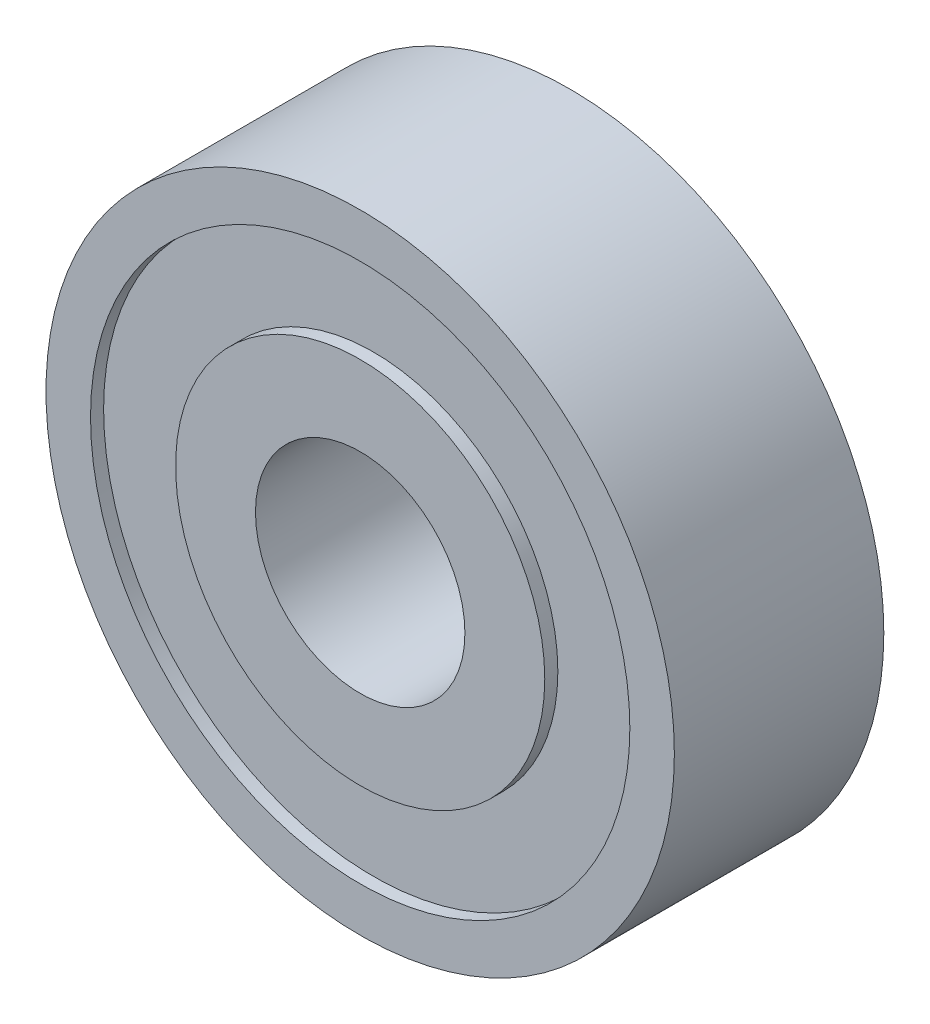
ISO-10303-21;
HEADER;
FILE_DESCRIPTION(('STEP AP214'),'2;1');
FILE_NAME('part.step','',(''),(''),'','','');
FILE_SCHEMA(('AUTOMOTIVE_DESIGN { 1 0 10303 214 1 1 1 1 }'));
ENDSEC;
DATA;
#1=APPLICATION_CONTEXT('core data for automotive mechanical design processes');
#2=APPLICATION_PROTOCOL_DEFINITION('international standard','automotive_design',2000,#1);
#3=PRODUCT_CONTEXT('',#1,'mechanical');
#4=PRODUCT('Part','Part','',(#3));
#5=PRODUCT_RELATED_PRODUCT_CATEGORY('part','',(#4));
#6=PRODUCT_DEFINITION_FORMATION('','',#4);
#7=PRODUCT_DEFINITION_CONTEXT('part definition',#1,'design');
#8=PRODUCT_DEFINITION('design','',#6,#7);
#9=PRODUCT_DEFINITION_SHAPE('','',#8);
#10=(LENGTH_UNIT() NAMED_UNIT(*) SI_UNIT(.MILLI.,.METRE.));
#11=(NAMED_UNIT(*) PLANE_ANGLE_UNIT() SI_UNIT($,.RADIAN.));
#12=(NAMED_UNIT(*) SI_UNIT($,.STERADIAN.) SOLID_ANGLE_UNIT());
#13=UNCERTAINTY_MEASURE_WITH_UNIT(LENGTH_MEASURE(1.E-05),#10,'distance_accuracy_value','');
#14=(GEOMETRIC_REPRESENTATION_CONTEXT(3) GLOBAL_UNCERTAINTY_ASSIGNED_CONTEXT((#13)) GLOBAL_UNIT_ASSIGNED_CONTEXT((#10,
#11,#12)) REPRESENTATION_CONTEXT('',''));
#15=CARTESIAN_POINT('',(0.,0.,0.));
#16=DIRECTION('',(0.,0.,1.));
#17=DIRECTION('',(1.,0.,0.));
#18=AXIS2_PLACEMENT_3D('',#15,#16,#17);
#19=CARTESIAN_POINT('',(0.,0.,-4.));
#20=DIRECTION('',(0.,0.,1.));
#21=DIRECTION('',(1.,0.,0.));
#22=AXIS2_PLACEMENT_3D('',#19,#20,#21);
#23=PLANE('',#22);
#24=CARTESIAN_POINT('',(0.,0.,-4.));
#25=DIRECTION('',(0.,0.,1.));
#26=DIRECTION('',(1.,0.,0.));
#27=AXIS2_PLACEMENT_3D('',#24,#25,#26);
#28=CIRCLE('',#27,4.);
#29=CARTESIAN_POINT('',(4.,0.,-4.));
#30=VERTEX_POINT('',#29);
#31=EDGE_CURVE('E41',#30,#30,#28,.T.);
#32=ORIENTED_EDGE('',*,*,#31,.T.);
#33=EDGE_LOOP('',(#32));
#34=FACE_BOUND('',#33,.T.);
#35=CARTESIAN_POINT('',(0.,0.,-4.));
#36=DIRECTION('',(0.,0.,1.));
#37=DIRECTION('',(1.,0.,0.));
#38=AXIS2_PLACEMENT_3D('',#35,#36,#37);
#39=CIRCLE('',#38,7.05);
#40=CARTESIAN_POINT('',(7.05,0.,-4.));
#41=VERTEX_POINT('',#40);
#42=EDGE_CURVE('E67',#41,#41,#39,.T.);
#43=ORIENTED_EDGE('',*,*,#42,.F.);
#44=EDGE_LOOP('',(#43));
#45=FACE_BOUND('',#44,.T.);
#46=ADVANCED_FACE('F30',(#34,#45),#23,.F.);
#47=CARTESIAN_POINT('',(0.,0.,4.));
#48=DIRECTION('',(0.,0.,1.));
#49=DIRECTION('',(1.,0.,0.));
#50=AXIS2_PLACEMENT_3D('',#47,#48,#49);
#51=PLANE('',#50);
#52=CARTESIAN_POINT('',(0.,0.,4.));
#53=DIRECTION('',(0.,0.,1.));
#54=DIRECTION('',(1.,0.,0.));
#55=AXIS2_PLACEMENT_3D('',#52,#53,#54);
#56=CIRCLE('',#55,4.);
#57=CARTESIAN_POINT('',(4.,0.,4.));
#58=VERTEX_POINT('',#57);
#59=EDGE_CURVE('E43',#58,#58,#56,.T.);
#60=ORIENTED_EDGE('',*,*,#59,.F.);
#61=EDGE_LOOP('',(#60));
#62=FACE_BOUND('',#61,.T.);
#63=CARTESIAN_POINT('',(0.,0.,4.));
#64=DIRECTION('',(0.,0.,1.));
#65=DIRECTION('',(1.,0.,0.));
#66=AXIS2_PLACEMENT_3D('',#63,#64,#65);
#67=CIRCLE('',#66,7.05);
#68=CARTESIAN_POINT('',(7.05,0.,4.));
#69=VERTEX_POINT('',#68);
#70=EDGE_CURVE('E55',#69,#69,#67,.T.);
#71=ORIENTED_EDGE('',*,*,#70,.T.);
#72=EDGE_LOOP('',(#71));
#73=FACE_BOUND('',#72,.T.);
#74=ADVANCED_FACE('F83',(#62,#73),#51,.T.);
#75=CARTESIAN_POINT('',(0.,0.,4.));
#76=DIRECTION('',(0.,0.,-1.));
#77=DIRECTION('',(-1.,0.,0.));
#78=AXIS2_PLACEMENT_3D('',#75,#76,#77);
#79=CYLINDRICAL_SURFACE('',#78,12.);
#80=CARTESIAN_POINT('',(0.,0.,4.));
#81=DIRECTION('',(0.,0.,1.));
#82=DIRECTION('',(1.,0.,0.));
#83=AXIS2_PLACEMENT_3D('',#80,#81,#82);
#84=CIRCLE('',#83,12.);
#85=CARTESIAN_POINT('',(12.,0.,4.));
#86=VERTEX_POINT('',#85);
#87=EDGE_CURVE('E10',#86,#86,#84,.T.);
#88=ORIENTED_EDGE('',*,*,#87,.F.);
#89=EDGE_LOOP('',(#88));
#90=FACE_BOUND('',#89,.T.);
#91=CARTESIAN_POINT('',(0.,0.,-4.));
#92=DIRECTION('',(0.,0.,1.));
#93=DIRECTION('',(1.,0.,0.));
#94=AXIS2_PLACEMENT_3D('',#91,#92,#93);
#95=CIRCLE('',#94,12.);
#96=CARTESIAN_POINT('',(12.,0.,-4.));
#97=VERTEX_POINT('',#96);
#98=EDGE_CURVE('E34',#97,#97,#95,.T.);
#99=ORIENTED_EDGE('',*,*,#98,.T.);
#100=EDGE_LOOP('',(#99));
#101=FACE_BOUND('',#100,.T.);
#102=ADVANCED_FACE('F32',(#90,#101),#79,.T.);
#103=CARTESIAN_POINT('',(0.,0.,4.));
#104=DIRECTION('',(0.,0.,1.));
#105=DIRECTION('',(1.,0.,0.));
#106=AXIS2_PLACEMENT_3D('',#103,#104,#105);
#107=CIRCLE('',#106,10.3);
#108=CARTESIAN_POINT('',(10.3,0.,4.));
#109=VERTEX_POINT('',#108);
#110=EDGE_CURVE('E49',#109,#109,#107,.T.);
#111=ORIENTED_EDGE('',*,*,#110,.F.);
#112=EDGE_LOOP('',(#111));
#113=FACE_BOUND('',#112,.T.);
#114=ORIENTED_EDGE('',*,*,#87,.T.);
#115=EDGE_LOOP('',(#114));
#116=FACE_BOUND('',#115,.T.);
#117=ADVANCED_FACE('F91',(#113,#116),#51,.T.);
#118=CARTESIAN_POINT('',(0.,0.,-4.));
#119=DIRECTION('',(0.,0.,1.));
#120=DIRECTION('',(1.,0.,0.));
#121=AXIS2_PLACEMENT_3D('',#118,#119,#120);
#122=CIRCLE('',#121,10.3);
#123=CARTESIAN_POINT('',(10.3,0.,-4.));
#124=VERTEX_POINT('',#123);
#125=EDGE_CURVE('E61',#124,#124,#122,.T.);
#126=ORIENTED_EDGE('',*,*,#125,.T.);
#127=EDGE_LOOP('',(#126));
#128=FACE_BOUND('',#127,.T.);
#129=ORIENTED_EDGE('',*,*,#98,.F.);
#130=EDGE_LOOP('',(#129));
#131=FACE_BOUND('',#130,.T.);
#132=ADVANCED_FACE('F85',(#128,#131),#23,.F.);
#133=CARTESIAN_POINT('',(0.,0.,-4.));
#134=DIRECTION('',(0.,0.,1.));
#135=DIRECTION('',(1.,0.,0.));
#136=AXIS2_PLACEMENT_3D('',#133,#134,#135);
#137=CYLINDRICAL_SURFACE('',#136,4.);
#138=ORIENTED_EDGE('',*,*,#31,.F.);
#139=EDGE_LOOP('',(#138));
#140=FACE_BOUND('',#139,.T.);
#141=ORIENTED_EDGE('',*,*,#59,.T.);
#142=EDGE_LOOP('',(#141));
#143=FACE_BOUND('',#142,.T.);
#144=ADVANCED_FACE('F93',(#140,#143),#137,.F.);
#145=CARTESIAN_POINT('',(0.,0.,3.5));
#146=DIRECTION('',(0.,0.,1.));
#147=DIRECTION('',(1.,0.,0.));
#148=AXIS2_PLACEMENT_3D('',#145,#146,#147);
#149=CYLINDRICAL_SURFACE('',#148,10.3);
#150=CARTESIAN_POINT('',(0.,0.,3.5));
#151=DIRECTION('',(0.,0.,1.));
#152=DIRECTION('',(1.,0.,0.));
#153=AXIS2_PLACEMENT_3D('',#150,#151,#152);
#154=CIRCLE('',#153,10.3);
#155=CARTESIAN_POINT('',(10.3,0.,3.5));
#156=VERTEX_POINT('',#155);
#157=EDGE_CURVE('E46',#156,#156,#154,.T.);
#158=ORIENTED_EDGE('',*,*,#157,.F.);
#159=EDGE_LOOP('',(#158));
#160=FACE_BOUND('',#159,.T.);
#161=ORIENTED_EDGE('',*,*,#110,.T.);
#162=EDGE_LOOP('',(#161));
#163=FACE_BOUND('',#162,.T.);
#164=ADVANCED_FACE('F99',(#160,#163),#149,.F.);
#165=CARTESIAN_POINT('',(0.,0.,3.5));
#166=DIRECTION('',(0.,0.,1.));
#167=DIRECTION('',(1.,0.,0.));
#168=AXIS2_PLACEMENT_3D('',#165,#166,#167);
#169=PLANE('',#168);
#170=CARTESIAN_POINT('',(0.,0.,3.5));
#171=DIRECTION('',(0.,0.,1.));
#172=DIRECTION('',(1.,0.,0.));
#173=AXIS2_PLACEMENT_3D('',#170,#171,#172);
#174=CIRCLE('',#173,7.05);
#175=CARTESIAN_POINT('',(7.05,0.,3.5));
#176=VERTEX_POINT('',#175);
#177=EDGE_CURVE('E52',#176,#176,#174,.T.);
#178=ORIENTED_EDGE('',*,*,#177,.F.);
#179=EDGE_LOOP('',(#178));
#180=FACE_BOUND('',#179,.T.);
#181=ORIENTED_EDGE('',*,*,#157,.T.);
#182=EDGE_LOOP('',(#181));
#183=FACE_BOUND('',#182,.T.);
#184=ADVANCED_FACE('F130',(#180,#183),#169,.T.);
#185=CARTESIAN_POINT('',(0.,0.,3.5));
#186=DIRECTION('',(0.,0.,1.));
#187=DIRECTION('',(1.,0.,0.));
#188=AXIS2_PLACEMENT_3D('',#185,#186,#187);
#189=CYLINDRICAL_SURFACE('',#188,7.05);
#190=ORIENTED_EDGE('',*,*,#177,.T.);
#191=EDGE_LOOP('',(#190));
#192=FACE_BOUND('',#191,.T.);
#193=ORIENTED_EDGE('',*,*,#70,.F.);
#194=EDGE_LOOP('',(#193));
#195=FACE_BOUND('',#194,.T.);
#196=ADVANCED_FACE('F140',(#192,#195),#189,.T.);
#197=CARTESIAN_POINT('',(0.,0.,-3.5));
#198=DIRECTION('',(0.,0.,-1.));
#199=DIRECTION('',(1.,0.,0.));
#200=AXIS2_PLACEMENT_3D('',#197,#198,#199);
#201=PLANE('',#200);
#202=CARTESIAN_POINT('',(0.,0.,-3.5));
#203=DIRECTION('',(0.,0.,1.));
#204=DIRECTION('',(1.,0.,0.));
#205=AXIS2_PLACEMENT_3D('',#202,#203,#204);
#206=CIRCLE('',#205,10.3);
#207=CARTESIAN_POINT('',(10.3,0.,-3.5));
#208=VERTEX_POINT('',#207);
#209=EDGE_CURVE('E58',#208,#208,#206,.T.);
#210=ORIENTED_EDGE('',*,*,#209,.F.);
#211=EDGE_LOOP('',(#210));
#212=FACE_BOUND('',#211,.T.);
#213=CARTESIAN_POINT('',(0.,0.,-3.5));
#214=DIRECTION('',(0.,0.,1.));
#215=DIRECTION('',(1.,0.,0.));
#216=AXIS2_PLACEMENT_3D('',#213,#214,#215);
#217=CIRCLE('',#216,7.05);
#218=CARTESIAN_POINT('',(7.05,0.,-3.5));
#219=VERTEX_POINT('',#218);
#220=EDGE_CURVE('E64',#219,#219,#217,.T.);
#221=ORIENTED_EDGE('',*,*,#220,.T.);
#222=EDGE_LOOP('',(#221));
#223=FACE_BOUND('',#222,.T.);
#224=ADVANCED_FACE('F73',(#212,#223),#201,.T.);
#225=CARTESIAN_POINT('',(0.,0.,-3.5));
#226=DIRECTION('',(0.,0.,-1.));
#227=DIRECTION('',(-1.,0.,0.));
#228=AXIS2_PLACEMENT_3D('',#225,#226,#227);
#229=CYLINDRICAL_SURFACE('',#228,10.3);
#230=ORIENTED_EDGE('',*,*,#209,.T.);
#231=EDGE_LOOP('',(#230));
#232=FACE_BOUND('',#231,.T.);
#233=ORIENTED_EDGE('',*,*,#125,.F.);
#234=EDGE_LOOP('',(#233));
#235=FACE_BOUND('',#234,.T.);
#236=ADVANCED_FACE('F78',(#232,#235),#229,.F.);
#237=CARTESIAN_POINT('',(0.,0.,-3.5));
#238=DIRECTION('',(0.,0.,-1.));
#239=DIRECTION('',(-1.,0.,0.));
#240=AXIS2_PLACEMENT_3D('',#237,#238,#239);
#241=CYLINDRICAL_SURFACE('',#240,7.05);
#242=ORIENTED_EDGE('',*,*,#220,.F.);
#243=EDGE_LOOP('',(#242));
#244=FACE_BOUND('',#243,.T.);
#245=ORIENTED_EDGE('',*,*,#42,.T.);
#246=EDGE_LOOP('',(#245));
#247=FACE_BOUND('',#246,.T.);
#248=ADVANCED_FACE('F75',(#244,#247),#241,.T.);
#249=CLOSED_SHELL('',(#46,#74,#102,#117,#132,#144,#164,#184,#196,#224,#236,#248));
#250=MANIFOLD_SOLID_BREP('B2',#249);
#251=ADVANCED_BREP_SHAPE_REPRESENTATION('',(#18,#250),#14);
#252=SHAPE_DEFINITION_REPRESENTATION(#9,#251);
ENDSEC;
END-ISO-10303-21;
